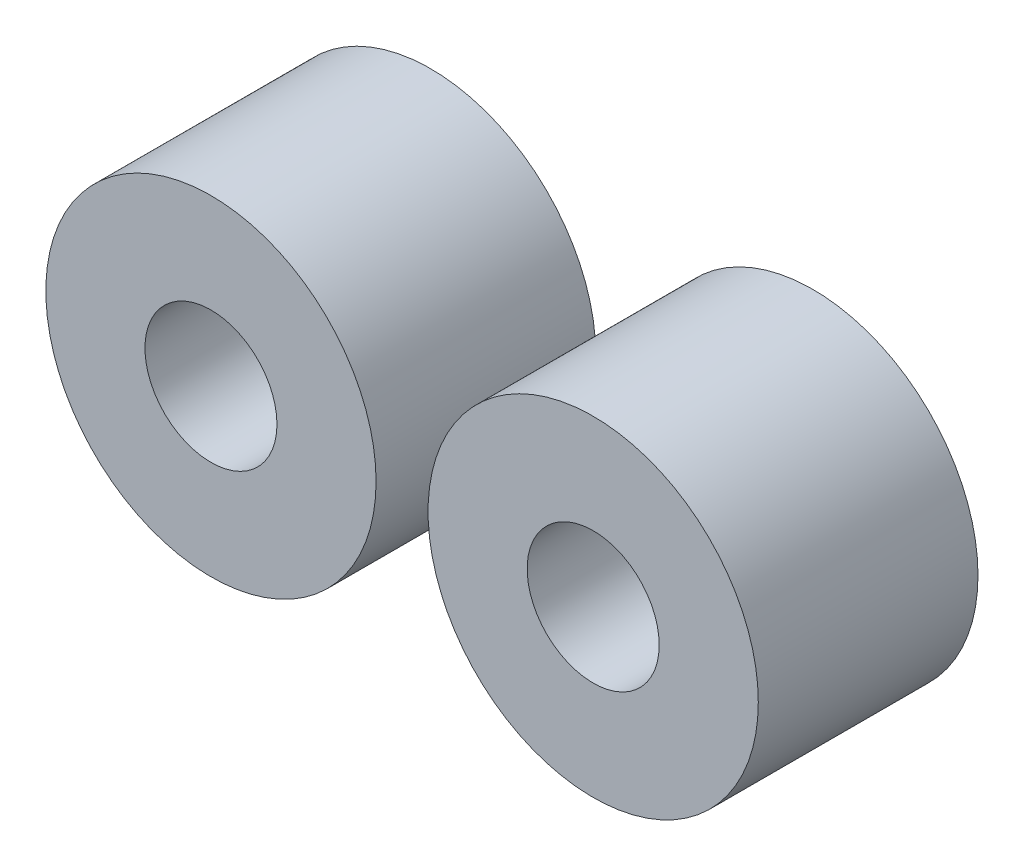
ISO-10303-21;
HEADER;
FILE_DESCRIPTION(('STEP AP214'),'2;1');
FILE_NAME('part.step','',(''),(''),'','','');
FILE_SCHEMA(('AUTOMOTIVE_DESIGN { 1 0 10303 214 1 1 1 1 }'));
ENDSEC;
DATA;
#1=APPLICATION_CONTEXT('core data for automotive mechanical design processes');
#2=APPLICATION_PROTOCOL_DEFINITION('international standard','automotive_design',2000,#1);
#3=PRODUCT_CONTEXT('',#1,'mechanical');
#4=PRODUCT('Part','Part','',(#3));
#5=PRODUCT_RELATED_PRODUCT_CATEGORY('part','',(#4));
#6=PRODUCT_DEFINITION_FORMATION('','',#4);
#7=PRODUCT_DEFINITION_CONTEXT('part definition',#1,'design');
#8=PRODUCT_DEFINITION('design','',#6,#7);
#9=PRODUCT_DEFINITION_SHAPE('','',#8);
#10=(LENGTH_UNIT() NAMED_UNIT(*) SI_UNIT(.MILLI.,.METRE.));
#11=(NAMED_UNIT(*) PLANE_ANGLE_UNIT() SI_UNIT($,.RADIAN.));
#12=(NAMED_UNIT(*) SI_UNIT($,.STERADIAN.) SOLID_ANGLE_UNIT());
#13=UNCERTAINTY_MEASURE_WITH_UNIT(LENGTH_MEASURE(1.E-05),#10,'distance_accuracy_value','');
#14=(GEOMETRIC_REPRESENTATION_CONTEXT(3) GLOBAL_UNCERTAINTY_ASSIGNED_CONTEXT((#13)) GLOBAL_UNIT_ASSIGNED_CONTEXT((#10,
#11,#12)) REPRESENTATION_CONTEXT('',''));
#15=CARTESIAN_POINT('',(0.,0.,0.));
#16=DIRECTION('',(0.,0.,1.));
#17=DIRECTION('',(1.,0.,0.));
#18=AXIS2_PLACEMENT_3D('',#15,#16,#17);
#19=CARTESIAN_POINT('',(0.,0.,1268.));
#20=DIRECTION('',(0.,0.,-1.));
#21=DIRECTION('',(-1.,0.,0.));
#22=AXIS2_PLACEMENT_3D('',#19,#20,#21);
#23=CYLINDRICAL_SURFACE('',#22,381.);
#24=CARTESIAN_POINT('',(0.,0.,1268.));
#25=DIRECTION('',(0.,0.,1.));
#26=DIRECTION('',(1.,0.,0.));
#27=AXIS2_PLACEMENT_3D('',#24,#25,#26);
#28=CIRCLE('',#27,381.);
#29=CARTESIAN_POINT('',(381.,0.,1268.));
#30=VERTEX_POINT('',#29);
#31=EDGE_CURVE('E52',#30,#30,#28,.T.);
#32=ORIENTED_EDGE('',*,*,#31,.T.);
#33=EDGE_LOOP('',(#32));
#34=FACE_BOUND('',#33,.T.);
#35=CARTESIAN_POINT('',(0.,0.,0.));
#36=DIRECTION('',(0.,0.,1.));
#37=DIRECTION('',(1.,0.,0.));
#38=AXIS2_PLACEMENT_3D('',#35,#36,#37);
#39=CIRCLE('',#38,381.);
#40=CARTESIAN_POINT('',(381.,0.,0.));
#41=VERTEX_POINT('',#40);
#42=EDGE_CURVE('E58',#41,#41,#39,.T.);
#43=ORIENTED_EDGE('',*,*,#42,.F.);
#44=EDGE_LOOP('',(#43));
#45=FACE_BOUND('',#44,.T.);
#46=ADVANCED_FACE('F45',(#34,#45),#23,.F.);
#47=CARTESIAN_POINT('',(0.,0.,1268.));
#48=DIRECTION('',(0.,0.,-1.));
#49=DIRECTION('',(-1.,0.,0.));
#50=AXIS2_PLACEMENT_3D('',#47,#48,#49);
#51=CYLINDRICAL_SURFACE('',#50,953.);
#52=CARTESIAN_POINT('',(0.,0.,1268.));
#53=DIRECTION('',(0.,0.,1.));
#54=DIRECTION('',(1.,0.,0.));
#55=AXIS2_PLACEMENT_3D('',#52,#53,#54);
#56=CIRCLE('',#55,953.);
#57=CARTESIAN_POINT('',(953.,0.,1268.));
#58=VERTEX_POINT('',#57);
#59=EDGE_CURVE('E11',#58,#58,#56,.T.);
#60=ORIENTED_EDGE('',*,*,#59,.F.);
#61=EDGE_LOOP('',(#60));
#62=FACE_BOUND('',#61,.T.);
#63=CARTESIAN_POINT('',(0.,0.,0.));
#64=DIRECTION('',(0.,0.,1.));
#65=DIRECTION('',(1.,0.,0.));
#66=AXIS2_PLACEMENT_3D('',#63,#64,#65);
#67=CIRCLE('',#66,953.);
#68=CARTESIAN_POINT('',(953.,0.,0.));
#69=VERTEX_POINT('',#68);
#70=EDGE_CURVE('E48',#69,#69,#67,.T.);
#71=ORIENTED_EDGE('',*,*,#70,.T.);
#72=EDGE_LOOP('',(#71));
#73=FACE_BOUND('',#72,.T.);
#74=ADVANCED_FACE('F65',(#62,#73),#51,.T.);
#75=CARTESIAN_POINT('',(0.,0.,1268.));
#76=DIRECTION('',(0.,0.,1.));
#77=DIRECTION('',(1.,0.,0.));
#78=AXIS2_PLACEMENT_3D('',#75,#76,#77);
#79=PLANE('',#78);
#80=ORIENTED_EDGE('',*,*,#31,.F.);
#81=EDGE_LOOP('',(#80));
#82=FACE_BOUND('',#81,.T.);
#83=ORIENTED_EDGE('',*,*,#59,.T.);
#84=EDGE_LOOP('',(#83));
#85=FACE_BOUND('',#84,.T.);
#86=ADVANCED_FACE('F69',(#82,#85),#79,.T.);
#87=CARTESIAN_POINT('',(0.,0.,0.));
#88=DIRECTION('',(0.,0.,1.));
#89=DIRECTION('',(1.,0.,0.));
#90=AXIS2_PLACEMENT_3D('',#87,#88,#89);
#91=PLANE('',#90);
#92=ORIENTED_EDGE('',*,*,#42,.T.);
#93=EDGE_LOOP('',(#92));
#94=FACE_BOUND('',#93,.T.);
#95=ORIENTED_EDGE('',*,*,#70,.F.);
#96=EDGE_LOOP('',(#95));
#97=FACE_BOUND('',#96,.T.);
#98=ADVANCED_FACE('F67',(#94,#97),#91,.F.);
#99=CLOSED_SHELL('',(#46,#74,#86,#98));
#100=MANIFOLD_SOLID_BREP('B2',#99);
#101=CARTESIAN_POINT('',(2206.,0.,1268.));
#102=DIRECTION('',(0.,0.,-1.));
#103=DIRECTION('',(-1.,0.,0.));
#104=AXIS2_PLACEMENT_3D('',#101,#102,#103);
#105=CYLINDRICAL_SURFACE('',#104,381.);
#106=CARTESIAN_POINT('',(2206.,0.,1268.));
#107=DIRECTION('',(0.,0.,1.));
#108=DIRECTION('',(1.,0.,0.));
#109=AXIS2_PLACEMENT_3D('',#106,#107,#108);
#110=CIRCLE('',#109,381.);
#111=CARTESIAN_POINT('',(2587.,0.,1268.));
#112=VERTEX_POINT('',#111);
#113=EDGE_CURVE('E118',#112,#112,#110,.T.);
#114=ORIENTED_EDGE('',*,*,#113,.T.);
#115=EDGE_LOOP('',(#114));
#116=FACE_BOUND('',#115,.T.);
#117=CARTESIAN_POINT('',(2206.,0.,0.));
#118=DIRECTION('',(0.,0.,1.));
#119=DIRECTION('',(1.,0.,0.));
#120=AXIS2_PLACEMENT_3D('',#117,#118,#119);
#121=CIRCLE('',#120,381.);
#122=CARTESIAN_POINT('',(2587.,0.,0.));
#123=VERTEX_POINT('',#122);
#124=EDGE_CURVE('E124',#123,#123,#121,.T.);
#125=ORIENTED_EDGE('',*,*,#124,.F.);
#126=EDGE_LOOP('',(#125));
#127=FACE_BOUND('',#126,.T.);
#128=ADVANCED_FACE('F111',(#116,#127),#105,.F.);
#129=CARTESIAN_POINT('',(2206.,0.,1268.));
#130=DIRECTION('',(0.,0.,-1.));
#131=DIRECTION('',(-1.,0.,0.));
#132=AXIS2_PLACEMENT_3D('',#129,#130,#131);
#133=CYLINDRICAL_SURFACE('',#132,953.);
#134=CARTESIAN_POINT('',(2206.,0.,1268.));
#135=DIRECTION('',(0.,0.,1.));
#136=DIRECTION('',(1.,0.,0.));
#137=AXIS2_PLACEMENT_3D('',#134,#135,#136);
#138=CIRCLE('',#137,953.);
#139=CARTESIAN_POINT('',(3159.,0.,1268.));
#140=VERTEX_POINT('',#139);
#141=EDGE_CURVE('E44',#140,#140,#138,.T.);
#142=ORIENTED_EDGE('',*,*,#141,.F.);
#143=EDGE_LOOP('',(#142));
#144=FACE_BOUND('',#143,.T.);
#145=CARTESIAN_POINT('',(2206.,0.,0.));
#146=DIRECTION('',(0.,0.,1.));
#147=DIRECTION('',(1.,0.,0.));
#148=AXIS2_PLACEMENT_3D('',#145,#146,#147);
#149=CIRCLE('',#148,953.);
#150=CARTESIAN_POINT('',(3159.,0.,0.));
#151=VERTEX_POINT('',#150);
#152=EDGE_CURVE('E114',#151,#151,#149,.T.);
#153=ORIENTED_EDGE('',*,*,#152,.T.);
#154=EDGE_LOOP('',(#153));
#155=FACE_BOUND('',#154,.T.);
#156=ADVANCED_FACE('F131',(#144,#155),#133,.T.);
#157=CARTESIAN_POINT('',(0.,0.,1268.));
#158=DIRECTION('',(0.,0.,1.));
#159=DIRECTION('',(1.,0.,0.));
#160=AXIS2_PLACEMENT_3D('',#157,#158,#159);
#161=PLANE('',#160);
#162=ORIENTED_EDGE('',*,*,#113,.F.);
#163=EDGE_LOOP('',(#162));
#164=FACE_BOUND('',#163,.T.);
#165=ORIENTED_EDGE('',*,*,#141,.T.);
#166=EDGE_LOOP('',(#165));
#167=FACE_BOUND('',#166,.T.);
#168=ADVANCED_FACE('F135',(#164,#167),#161,.T.);
#169=CARTESIAN_POINT('',(0.,0.,0.));
#170=DIRECTION('',(0.,0.,1.));
#171=DIRECTION('',(1.,0.,0.));
#172=AXIS2_PLACEMENT_3D('',#169,#170,#171);
#173=PLANE('',#172);
#174=ORIENTED_EDGE('',*,*,#124,.T.);
#175=EDGE_LOOP('',(#174));
#176=FACE_BOUND('',#175,.T.);
#177=ORIENTED_EDGE('',*,*,#152,.F.);
#178=EDGE_LOOP('',(#177));
#179=FACE_BOUND('',#178,.T.);
#180=ADVANCED_FACE('F133',(#176,#179),#173,.F.);
#181=CLOSED_SHELL('',(#128,#156,#168,#180));
#182=MANIFOLD_SOLID_BREP('B6',#181);
#183=ADVANCED_BREP_SHAPE_REPRESENTATION('',(#18,#100,#182),#14);
#184=SHAPE_DEFINITION_REPRESENTATION(#9,#183);
ENDSEC;
END-ISO-10303-21;
